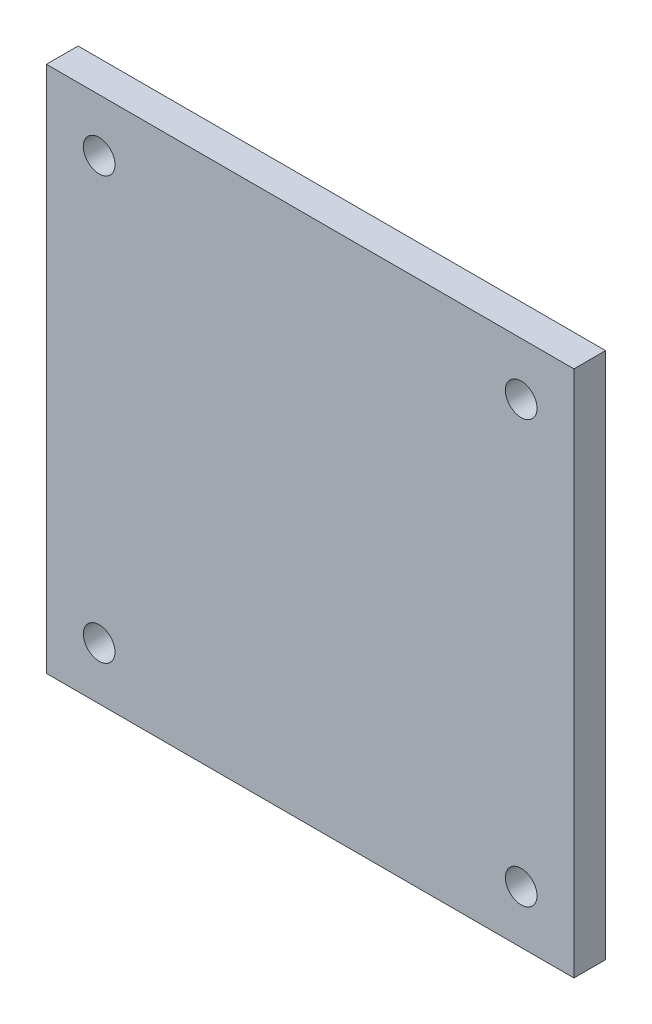
ISO-10303-21;
HEADER;
FILE_DESCRIPTION(('STEP AP214'),'2;1');
FILE_NAME('part.step','',(''),(''),'','','');
FILE_SCHEMA(('AUTOMOTIVE_DESIGN { 1 0 10303 214 1 1 1 1 }'));
ENDSEC;
DATA;
#1=APPLICATION_CONTEXT('core data for automotive mechanical design processes');
#2=APPLICATION_PROTOCOL_DEFINITION('international standard','automotive_design',2000,#1);
#3=PRODUCT_CONTEXT('',#1,'mechanical');
#4=PRODUCT('Part','Part','',(#3));
#5=PRODUCT_RELATED_PRODUCT_CATEGORY('part','',(#4));
#6=PRODUCT_DEFINITION_FORMATION('','',#4);
#7=PRODUCT_DEFINITION_CONTEXT('part definition',#1,'design');
#8=PRODUCT_DEFINITION('design','',#6,#7);
#9=PRODUCT_DEFINITION_SHAPE('','',#8);
#10=(LENGTH_UNIT() NAMED_UNIT(*) SI_UNIT(.MILLI.,.METRE.));
#11=(NAMED_UNIT(*) PLANE_ANGLE_UNIT() SI_UNIT($,.RADIAN.));
#12=(NAMED_UNIT(*) SI_UNIT($,.STERADIAN.) SOLID_ANGLE_UNIT());
#13=UNCERTAINTY_MEASURE_WITH_UNIT(LENGTH_MEASURE(1.E-05),#10,'distance_accuracy_value','');
#14=(GEOMETRIC_REPRESENTATION_CONTEXT(3) GLOBAL_UNCERTAINTY_ASSIGNED_CONTEXT((#13)) GLOBAL_UNIT_ASSIGNED_CONTEXT((#10,
#11,#12)) REPRESENTATION_CONTEXT('',''));
#15=CARTESIAN_POINT('',(0.,0.,0.));
#16=DIRECTION('',(0.,0.,1.));
#17=DIRECTION('',(1.,0.,0.));
#18=AXIS2_PLACEMENT_3D('',#15,#16,#17);
#19=CARTESIAN_POINT('',(0.,0.,3.));
#20=DIRECTION('',(0.,0.,-1.));
#21=DIRECTION('',(-1.,0.,0.));
#22=AXIS2_PLACEMENT_3D('',#19,#20,#21);
#23=PLANE('',#22);
#24=DIRECTION('',(0.,-1.,0.));
#25=VECTOR('',#24,1.);
#26=CARTESIAN_POINT('',(0.,0.,3.));
#27=LINE('',#26,#25);
#28=CARTESIAN_POINT('',(0.,50.,3.));
#29=VERTEX_POINT('',#28);
#30=CARTESIAN_POINT('',(0.,0.,3.));
#31=VERTEX_POINT('',#30);
#32=EDGE_CURVE('E87',#29,#31,#27,.T.);
#33=ORIENTED_EDGE('',*,*,#32,.T.);
#34=DIRECTION('',(1.,0.,0.));
#35=VECTOR('',#34,1.);
#36=CARTESIAN_POINT('',(0.,0.,3.));
#37=LINE('',#36,#35);
#38=CARTESIAN_POINT('',(50.,0.,3.));
#39=VERTEX_POINT('',#38);
#40=EDGE_CURVE('E82',#31,#39,#37,.T.);
#41=ORIENTED_EDGE('',*,*,#40,.T.);
#42=DIRECTION('',(0.,1.,0.));
#43=VECTOR('',#42,1.);
#44=CARTESIAN_POINT('',(50.,0.,3.));
#45=LINE('',#44,#43);
#46=CARTESIAN_POINT('',(50.,50.,3.));
#47=VERTEX_POINT('',#46);
#48=EDGE_CURVE('E85',#39,#47,#45,.T.);
#49=ORIENTED_EDGE('',*,*,#48,.T.);
#50=DIRECTION('',(-1.,0.,0.));
#51=VECTOR('',#50,1.);
#52=CARTESIAN_POINT('',(0.,50.,3.));
#53=LINE('',#52,#51);
#54=EDGE_CURVE('E52',#47,#29,#53,.T.);
#55=ORIENTED_EDGE('',*,*,#54,.T.);
#56=EDGE_LOOP('',(#33,#41,#49,#55));
#57=FACE_BOUND('',#56,.T.);
#58=CARTESIAN_POINT('',(5.,45.,3.));
#59=DIRECTION('',(0.,0.,1.));
#60=DIRECTION('',(1.,0.,0.));
#61=AXIS2_PLACEMENT_3D('',#58,#59,#60);
#62=CIRCLE('',#61,1.5);
#63=CARTESIAN_POINT('',(6.5,45.,3.));
#64=VERTEX_POINT('',#63);
#65=EDGE_CURVE('E102',#64,#64,#62,.T.);
#66=ORIENTED_EDGE('',*,*,#65,.F.);
#67=EDGE_LOOP('',(#66));
#68=FACE_BOUND('',#67,.T.);
#69=CARTESIAN_POINT('',(45.0000000000001,45.0000000000011,3.));
#70=DIRECTION('',(0.,0.,1.));
#71=DIRECTION('',(1.,0.,0.));
#72=AXIS2_PLACEMENT_3D('',#69,#70,#71);
#73=CIRCLE('',#72,1.5);
#74=CARTESIAN_POINT('',(46.5000000000001,45.0000000000011,3.));
#75=VERTEX_POINT('',#74);
#76=EDGE_CURVE('E117',#75,#75,#73,.T.);
#77=ORIENTED_EDGE('',*,*,#76,.F.);
#78=EDGE_LOOP('',(#77));
#79=FACE_BOUND('',#78,.T.);
#80=CARTESIAN_POINT('',(45.000000000001,5.00000000000099,3.));
#81=DIRECTION('',(0.,0.,1.));
#82=DIRECTION('',(1.,0.,0.));
#83=AXIS2_PLACEMENT_3D('',#80,#81,#82);
#84=CIRCLE('',#83,1.5);
#85=CARTESIAN_POINT('',(46.500000000001,5.00000000000099,3.));
#86=VERTEX_POINT('',#85);
#87=EDGE_CURVE('E123',#86,#86,#84,.T.);
#88=ORIENTED_EDGE('',*,*,#87,.F.);
#89=EDGE_LOOP('',(#88));
#90=FACE_BOUND('',#89,.T.);
#91=CARTESIAN_POINT('',(5.00000000000092,5.00000000000021,3.));
#92=DIRECTION('',(0.,0.,1.));
#93=DIRECTION('',(1.,0.,0.));
#94=AXIS2_PLACEMENT_3D('',#91,#92,#93);
#95=CIRCLE('',#94,1.5);
#96=CARTESIAN_POINT('',(6.50000000000092,5.00000000000021,3.));
#97=VERTEX_POINT('',#96);
#98=EDGE_CURVE('E129',#97,#97,#95,.T.);
#99=ORIENTED_EDGE('',*,*,#98,.F.);
#100=EDGE_LOOP('',(#99));
#101=FACE_BOUND('',#100,.T.);
#102=ADVANCED_FACE('F35',(#57,#68,#79,#90,#101),#23,.F.);
#103=CARTESIAN_POINT('',(0.,0.,0.));
#104=DIRECTION('',(0.,0.,-1.));
#105=DIRECTION('',(-1.,0.,0.));
#106=AXIS2_PLACEMENT_3D('',#103,#104,#105);
#107=PLANE('',#106);
#108=CARTESIAN_POINT('',(45.000000000001,5.00000000000099,0.));
#109=DIRECTION('',(0.,0.,1.));
#110=DIRECTION('',(1.,0.,0.));
#111=AXIS2_PLACEMENT_3D('',#108,#109,#110);
#112=CIRCLE('',#111,1.5);
#113=CARTESIAN_POINT('',(46.500000000001,5.00000000000099,0.));
#114=VERTEX_POINT('',#113);
#115=EDGE_CURVE('E126',#114,#114,#112,.T.);
#116=ORIENTED_EDGE('',*,*,#115,.T.);
#117=EDGE_LOOP('',(#116));
#118=FACE_BOUND('',#117,.T.);
#119=CARTESIAN_POINT('',(5.,45.,0.));
#120=DIRECTION('',(0.,0.,1.));
#121=DIRECTION('',(1.,0.,0.));
#122=AXIS2_PLACEMENT_3D('',#119,#120,#121);
#123=CIRCLE('',#122,1.5);
#124=CARTESIAN_POINT('',(6.5,45.,0.));
#125=VERTEX_POINT('',#124);
#126=EDGE_CURVE('E114',#125,#125,#123,.T.);
#127=ORIENTED_EDGE('',*,*,#126,.T.);
#128=EDGE_LOOP('',(#127));
#129=FACE_BOUND('',#128,.T.);
#130=DIRECTION('',(0.,-1.,0.));
#131=VECTOR('',#130,1.);
#132=CARTESIAN_POINT('',(0.,0.,0.));
#133=LINE('',#132,#131);
#134=CARTESIAN_POINT('',(0.,50.,0.));
#135=VERTEX_POINT('',#134);
#136=CARTESIAN_POINT('',(0.,0.,0.));
#137=VERTEX_POINT('',#136);
#138=EDGE_CURVE('E99',#135,#137,#133,.T.);
#139=ORIENTED_EDGE('',*,*,#138,.F.);
#140=DIRECTION('',(-1.,0.,0.));
#141=VECTOR('',#140,1.);
#142=CARTESIAN_POINT('',(0.,50.,0.));
#143=LINE('',#142,#141);
#144=CARTESIAN_POINT('',(50.,50.,0.));
#145=VERTEX_POINT('',#144);
#146=EDGE_CURVE('E75',#145,#135,#143,.T.);
#147=ORIENTED_EDGE('',*,*,#146,.F.);
#148=DIRECTION('',(0.,1.,0.));
#149=VECTOR('',#148,1.);
#150=CARTESIAN_POINT('',(50.,0.,0.));
#151=LINE('',#150,#149);
#152=CARTESIAN_POINT('',(50.,0.,0.));
#153=VERTEX_POINT('',#152);
#154=EDGE_CURVE('E69',#153,#145,#151,.T.);
#155=ORIENTED_EDGE('',*,*,#154,.F.);
#156=DIRECTION('',(1.,0.,0.));
#157=VECTOR('',#156,1.);
#158=CARTESIAN_POINT('',(0.,0.,0.));
#159=LINE('',#158,#157);
#160=EDGE_CURVE('E91',#137,#153,#159,.T.);
#161=ORIENTED_EDGE('',*,*,#160,.F.);
#162=EDGE_LOOP('',(#139,#147,#155,#161));
#163=FACE_BOUND('',#162,.T.);
#164=CARTESIAN_POINT('',(45.0000000000001,45.0000000000011,0.));
#165=DIRECTION('',(0.,0.,1.));
#166=DIRECTION('',(1.,0.,0.));
#167=AXIS2_PLACEMENT_3D('',#164,#165,#166);
#168=CIRCLE('',#167,1.5);
#169=CARTESIAN_POINT('',(46.5000000000001,45.0000000000011,0.));
#170=VERTEX_POINT('',#169);
#171=EDGE_CURVE('E120',#170,#170,#168,.T.);
#172=ORIENTED_EDGE('',*,*,#171,.T.);
#173=EDGE_LOOP('',(#172));
#174=FACE_BOUND('',#173,.T.);
#175=CARTESIAN_POINT('',(5.00000000000092,5.00000000000021,0.));
#176=DIRECTION('',(0.,0.,1.));
#177=DIRECTION('',(1.,0.,0.));
#178=AXIS2_PLACEMENT_3D('',#175,#176,#177);
#179=CIRCLE('',#178,1.5);
#180=CARTESIAN_POINT('',(6.50000000000092,5.00000000000021,0.));
#181=VERTEX_POINT('',#180);
#182=EDGE_CURVE('E132',#181,#181,#179,.T.);
#183=ORIENTED_EDGE('',*,*,#182,.T.);
#184=EDGE_LOOP('',(#183));
#185=FACE_BOUND('',#184,.T.);
#186=ADVANCED_FACE('F110',(#118,#129,#163,#174,#185),#107,.T.);
#187=CARTESIAN_POINT('',(0.,0.,3.));
#188=DIRECTION('',(1.,0.,0.));
#189=DIRECTION('',(0.,1.,0.));
#190=AXIS2_PLACEMENT_3D('',#187,#188,#189);
#191=PLANE('',#190);
#192=ORIENTED_EDGE('',*,*,#138,.T.);
#193=DIRECTION('',(0.,0.,-1.));
#194=VECTOR('',#193,1.);
#195=CARTESIAN_POINT('',(0.,0.,3.));
#196=LINE('',#195,#194);
#197=EDGE_CURVE('E11',#31,#137,#196,.T.);
#198=ORIENTED_EDGE('',*,*,#197,.F.);
#199=ORIENTED_EDGE('',*,*,#32,.F.);
#200=DIRECTION('',(0.,0.,-1.));
#201=VECTOR('',#200,1.);
#202=CARTESIAN_POINT('',(0.,50.,3.));
#203=LINE('',#202,#201);
#204=EDGE_CURVE('E95',#29,#135,#203,.T.);
#205=ORIENTED_EDGE('',*,*,#204,.T.);
#206=EDGE_LOOP('',(#192,#198,#199,#205));
#207=FACE_BOUND('',#206,.T.);
#208=ADVANCED_FACE('F37',(#207),#191,.F.);
#209=CARTESIAN_POINT('',(0.,0.,3.));
#210=DIRECTION('',(0.,1.,0.));
#211=DIRECTION('',(0.,0.,1.));
#212=AXIS2_PLACEMENT_3D('',#209,#210,#211);
#213=PLANE('',#212);
#214=ORIENTED_EDGE('',*,*,#160,.T.);
#215=DIRECTION('',(0.,0.,-1.));
#216=VECTOR('',#215,1.);
#217=CARTESIAN_POINT('',(50.,0.,3.));
#218=LINE('',#217,#216);
#219=EDGE_CURVE('E44',#39,#153,#218,.T.);
#220=ORIENTED_EDGE('',*,*,#219,.F.);
#221=ORIENTED_EDGE('',*,*,#40,.F.);
#222=ORIENTED_EDGE('',*,*,#197,.T.);
#223=EDGE_LOOP('',(#214,#220,#221,#222));
#224=FACE_BOUND('',#223,.T.);
#225=ADVANCED_FACE('F90',(#224),#213,.F.);
#226=CARTESIAN_POINT('',(50.,0.,3.));
#227=DIRECTION('',(-1.,0.,0.));
#228=DIRECTION('',(0.,-1.,0.));
#229=AXIS2_PLACEMENT_3D('',#226,#227,#228);
#230=PLANE('',#229);
#231=ORIENTED_EDGE('',*,*,#154,.T.);
#232=DIRECTION('',(0.,0.,-1.));
#233=VECTOR('',#232,1.);
#234=CARTESIAN_POINT('',(50.,50.,3.));
#235=LINE('',#234,#233);
#236=EDGE_CURVE('E92',#47,#145,#235,.T.);
#237=ORIENTED_EDGE('',*,*,#236,.F.);
#238=ORIENTED_EDGE('',*,*,#48,.F.);
#239=ORIENTED_EDGE('',*,*,#219,.T.);
#240=EDGE_LOOP('',(#231,#237,#238,#239));
#241=FACE_BOUND('',#240,.T.);
#242=ADVANCED_FACE('F93',(#241),#230,.F.);
#243=CARTESIAN_POINT('',(0.,50.,3.));
#244=DIRECTION('',(0.,-1.,0.));
#245=DIRECTION('',(0.,0.,-1.));
#246=AXIS2_PLACEMENT_3D('',#243,#244,#245);
#247=PLANE('',#246);
#248=ORIENTED_EDGE('',*,*,#146,.T.);
#249=ORIENTED_EDGE('',*,*,#204,.F.);
#250=ORIENTED_EDGE('',*,*,#54,.F.);
#251=ORIENTED_EDGE('',*,*,#236,.T.);
#252=EDGE_LOOP('',(#248,#249,#250,#251));
#253=FACE_BOUND('',#252,.T.);
#254=ADVANCED_FACE('F107',(#253),#247,.F.);
#255=CARTESIAN_POINT('',(5.,45.,3.));
#256=DIRECTION('',(0.,0.,-1.));
#257=DIRECTION('',(-1.,0.,0.));
#258=AXIS2_PLACEMENT_3D('',#255,#256,#257);
#259=CYLINDRICAL_SURFACE('',#258,1.5);
#260=ORIENTED_EDGE('',*,*,#65,.T.);
#261=EDGE_LOOP('',(#260));
#262=FACE_BOUND('',#261,.T.);
#263=ORIENTED_EDGE('',*,*,#126,.F.);
#264=EDGE_LOOP('',(#263));
#265=FACE_BOUND('',#264,.T.);
#266=ADVANCED_FACE('F149',(#262,#265),#259,.F.);
#267=CARTESIAN_POINT('',(45.0000000000001,45.0000000000011,3.));
#268=DIRECTION('',(0.,0.,-1.));
#269=DIRECTION('',(-1.,0.,0.));
#270=AXIS2_PLACEMENT_3D('',#267,#268,#269);
#271=CYLINDRICAL_SURFACE('',#270,1.5);
#272=ORIENTED_EDGE('',*,*,#76,.T.);
#273=EDGE_LOOP('',(#272));
#274=FACE_BOUND('',#273,.T.);
#275=ORIENTED_EDGE('',*,*,#171,.F.);
#276=EDGE_LOOP('',(#275));
#277=FACE_BOUND('',#276,.T.);
#278=ADVANCED_FACE('F195',(#274,#277),#271,.F.);
#279=CARTESIAN_POINT('',(45.000000000001,5.00000000000099,3.));
#280=DIRECTION('',(0.,0.,-1.));
#281=DIRECTION('',(-1.,0.,0.));
#282=AXIS2_PLACEMENT_3D('',#279,#280,#281);
#283=CYLINDRICAL_SURFACE('',#282,1.5);
#284=ORIENTED_EDGE('',*,*,#87,.T.);
#285=EDGE_LOOP('',(#284));
#286=FACE_BOUND('',#285,.T.);
#287=ORIENTED_EDGE('',*,*,#115,.F.);
#288=EDGE_LOOP('',(#287));
#289=FACE_BOUND('',#288,.T.);
#290=ADVANCED_FACE('F203',(#286,#289),#283,.F.);
#291=CARTESIAN_POINT('',(5.00000000000092,5.00000000000021,3.));
#292=DIRECTION('',(0.,0.,-1.));
#293=DIRECTION('',(-1.,0.,0.));
#294=AXIS2_PLACEMENT_3D('',#291,#292,#293);
#295=CYLINDRICAL_SURFACE('',#294,1.5);
#296=ORIENTED_EDGE('',*,*,#98,.T.);
#297=EDGE_LOOP('',(#296));
#298=FACE_BOUND('',#297,.T.);
#299=ORIENTED_EDGE('',*,*,#182,.F.);
#300=EDGE_LOOP('',(#299));
#301=FACE_BOUND('',#300,.T.);
#302=ADVANCED_FACE('F138',(#298,#301),#295,.F.);
#303=CLOSED_SHELL('',(#102,#186,#208,#225,#242,#254,#266,#278,#290,#302));
#304=MANIFOLD_SOLID_BREP('B2',#303);
#305=ADVANCED_BREP_SHAPE_REPRESENTATION('',(#18,#304),#14);
#306=SHAPE_DEFINITION_REPRESENTATION(#9,#305);
ENDSEC;
END-ISO-10303-21;
